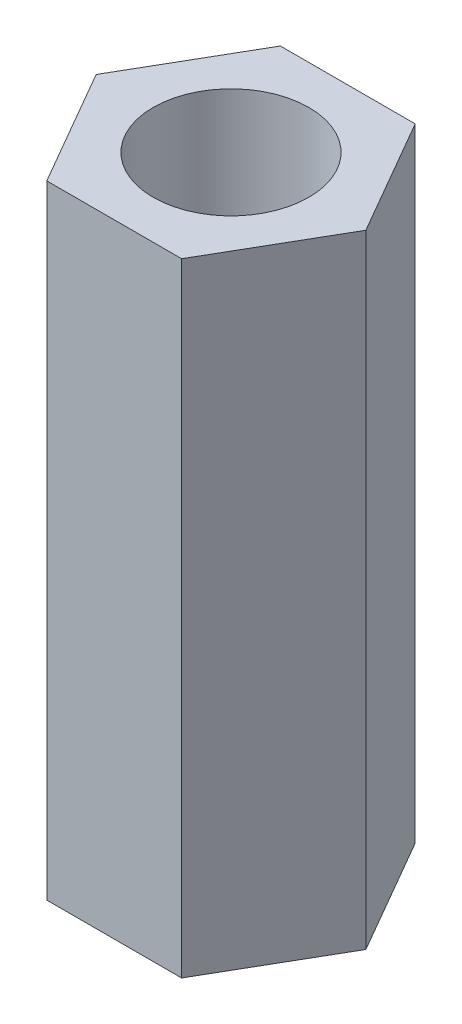
ISO-10303-21;
HEADER;
FILE_DESCRIPTION(('STEP AP214'),'2;1');
FILE_NAME('part.step','',(''),(''),'','','');
FILE_SCHEMA(('AUTOMOTIVE_DESIGN { 1 0 10303 214 1 1 1 1 }'));
ENDSEC;
DATA;
#1=APPLICATION_CONTEXT('core data for automotive mechanical design processes');
#2=APPLICATION_PROTOCOL_DEFINITION('international standard','automotive_design',2000,#1);
#3=PRODUCT_CONTEXT('',#1,'mechanical');
#4=PRODUCT('Part','Part','',(#3));
#5=PRODUCT_RELATED_PRODUCT_CATEGORY('part','',(#4));
#6=PRODUCT_DEFINITION_FORMATION('','',#4);
#7=PRODUCT_DEFINITION_CONTEXT('part definition',#1,'design');
#8=PRODUCT_DEFINITION('design','',#6,#7);
#9=PRODUCT_DEFINITION_SHAPE('','',#8);
#10=(LENGTH_UNIT() NAMED_UNIT(*) SI_UNIT(.MILLI.,.METRE.));
#11=(NAMED_UNIT(*) PLANE_ANGLE_UNIT() SI_UNIT($,.RADIAN.));
#12=(NAMED_UNIT(*) SI_UNIT($,.STERADIAN.) SOLID_ANGLE_UNIT());
#13=UNCERTAINTY_MEASURE_WITH_UNIT(LENGTH_MEASURE(1.E-05),#10,'distance_accuracy_value','');
#14=(GEOMETRIC_REPRESENTATION_CONTEXT(3) GLOBAL_UNCERTAINTY_ASSIGNED_CONTEXT((#13)) GLOBAL_UNIT_ASSIGNED_CONTEXT((#10,
#11,#12)) REPRESENTATION_CONTEXT('',''));
#15=CARTESIAN_POINT('',(0.,0.,0.));
#16=DIRECTION('',(0.,0.,1.));
#17=DIRECTION('',(1.,0.,0.));
#18=AXIS2_PLACEMENT_3D('',#15,#16,#17);
#19=CARTESIAN_POINT('',(1.29903810567666,12.,-2.25));
#20=DIRECTION('',(0.,0.,1.));
#21=DIRECTION('',(1.,0.,0.));
#22=AXIS2_PLACEMENT_3D('',#19,#20,#21);
#23=PLANE('',#22);
#24=DIRECTION('',(-1.,0.,0.));
#25=VECTOR('',#24,1.);
#26=CARTESIAN_POINT('',(1.29903810567666,0.,-2.25));
#27=LINE('',#26,#25);
#28=CARTESIAN_POINT('',(1.29903810567666,0.,-2.25));
#29=VERTEX_POINT('',#28);
#30=CARTESIAN_POINT('',(-1.29903810567666,0.,-2.25));
#31=VERTEX_POINT('',#30);
#32=EDGE_CURVE('E117',#29,#31,#27,.T.);
#33=ORIENTED_EDGE('',*,*,#32,.T.);
#34=DIRECTION('',(0.,-1.,0.));
#35=VECTOR('',#34,1.);
#36=CARTESIAN_POINT('',(-1.29903810567666,12.,-2.25));
#37=LINE('',#36,#35);
#38=CARTESIAN_POINT('',(-1.29903810567666,12.,-2.25));
#39=VERTEX_POINT('',#38);
#40=EDGE_CURVE('E11',#39,#31,#37,.T.);
#41=ORIENTED_EDGE('',*,*,#40,.F.);
#42=DIRECTION('',(-1.,0.,0.));
#43=VECTOR('',#42,1.);
#44=CARTESIAN_POINT('',(1.29903810567666,12.,-2.25));
#45=LINE('',#44,#43);
#46=CARTESIAN_POINT('',(1.29903810567666,12.,-2.25));
#47=VERTEX_POINT('',#46);
#48=EDGE_CURVE('E128',#47,#39,#45,.T.);
#49=ORIENTED_EDGE('',*,*,#48,.F.);
#50=DIRECTION('',(0.,-1.,0.));
#51=VECTOR('',#50,1.);
#52=CARTESIAN_POINT('',(1.29903810567666,12.,-2.25));
#53=LINE('',#52,#51);
#54=EDGE_CURVE('E113',#47,#29,#53,.T.);
#55=ORIENTED_EDGE('',*,*,#54,.T.);
#56=EDGE_LOOP('',(#33,#41,#49,#55));
#57=FACE_BOUND('',#56,.T.);
#58=ADVANCED_FACE('F33',(#57),#23,.F.);
#59=CARTESIAN_POINT('',(-1.29903810567666,12.,-2.25));
#60=DIRECTION('',(0.866025403784439,0.,0.5));
#61=DIRECTION('',(0.5,0.,-0.866025403784439));
#62=AXIS2_PLACEMENT_3D('',#59,#60,#61);
#63=PLANE('',#62);
#64=DIRECTION('',(-0.5,0.,0.866025403784439));
#65=VECTOR('',#64,1.);
#66=CARTESIAN_POINT('',(-1.29903810567666,0.,-2.25));
#67=LINE('',#66,#65);
#68=CARTESIAN_POINT('',(-2.59807621135332,0.,0.));
#69=VERTEX_POINT('',#68);
#70=EDGE_CURVE('E120',#31,#69,#67,.T.);
#71=ORIENTED_EDGE('',*,*,#70,.T.);
#72=DIRECTION('',(0.,-1.,0.));
#73=VECTOR('',#72,1.);
#74=CARTESIAN_POINT('',(-2.59807621135332,12.,0.));
#75=LINE('',#74,#73);
#76=CARTESIAN_POINT('',(-2.59807621135332,12.,0.));
#77=VERTEX_POINT('',#76);
#78=EDGE_CURVE('E41',#77,#69,#75,.T.);
#79=ORIENTED_EDGE('',*,*,#78,.F.);
#80=DIRECTION('',(-0.5,0.,0.866025403784439));
#81=VECTOR('',#80,1.);
#82=CARTESIAN_POINT('',(-1.29903810567666,12.,-2.25));
#83=LINE('',#82,#81);
#84=EDGE_CURVE('E86',#39,#77,#83,.T.);
#85=ORIENTED_EDGE('',*,*,#84,.F.);
#86=ORIENTED_EDGE('',*,*,#40,.T.);
#87=EDGE_LOOP('',(#71,#79,#85,#86));
#88=FACE_BOUND('',#87,.T.);
#89=ADVANCED_FACE('F153',(#88),#63,.F.);
#90=CARTESIAN_POINT('',(-2.59807621135332,12.,0.));
#91=DIRECTION('',(0.866025403784438,0.,-0.5));
#92=DIRECTION('',(-0.5,0.,-0.866025403784439));
#93=AXIS2_PLACEMENT_3D('',#90,#91,#92);
#94=PLANE('',#93);
#95=DIRECTION('',(0.5,0.,0.866025403784438));
#96=VECTOR('',#95,1.);
#97=CARTESIAN_POINT('',(-2.59807621135332,0.,0.));
#98=LINE('',#97,#96);
#99=CARTESIAN_POINT('',(-1.29903810567666,0.,2.25));
#100=VERTEX_POINT('',#99);
#101=EDGE_CURVE('E123',#69,#100,#98,.T.);
#102=ORIENTED_EDGE('',*,*,#101,.T.);
#103=DIRECTION('',(0.,-1.,0.));
#104=VECTOR('',#103,1.);
#105=CARTESIAN_POINT('',(-1.29903810567666,12.,2.25));
#106=LINE('',#105,#104);
#107=CARTESIAN_POINT('',(-1.29903810567666,12.,2.25));
#108=VERTEX_POINT('',#107);
#109=EDGE_CURVE('E108',#108,#100,#106,.T.);
#110=ORIENTED_EDGE('',*,*,#109,.F.);
#111=DIRECTION('',(0.5,0.,0.866025403784438));
#112=VECTOR('',#111,1.);
#113=CARTESIAN_POINT('',(-2.59807621135332,12.,0.));
#114=LINE('',#113,#112);
#115=EDGE_CURVE('E99',#77,#108,#114,.T.);
#116=ORIENTED_EDGE('',*,*,#115,.F.);
#117=ORIENTED_EDGE('',*,*,#78,.T.);
#118=EDGE_LOOP('',(#102,#110,#116,#117));
#119=FACE_BOUND('',#118,.T.);
#120=ADVANCED_FACE('F134',(#119),#94,.F.);
#121=CARTESIAN_POINT('',(-1.29903810567666,12.,2.25));
#122=DIRECTION('',(0.,0.,-1.));
#123=DIRECTION('',(-1.,0.,0.));
#124=AXIS2_PLACEMENT_3D('',#121,#122,#123);
#125=PLANE('',#124);
#126=DIRECTION('',(1.,0.,0.));
#127=VECTOR('',#126,1.);
#128=CARTESIAN_POINT('',(-1.29903810567666,0.,2.25));
#129=LINE('',#128,#127);
#130=CARTESIAN_POINT('',(1.29903810567666,0.,2.25));
#131=VERTEX_POINT('',#130);
#132=EDGE_CURVE('E107',#100,#131,#129,.T.);
#133=ORIENTED_EDGE('',*,*,#132,.T.);
#134=DIRECTION('',(0.,-1.,0.));
#135=VECTOR('',#134,1.);
#136=CARTESIAN_POINT('',(1.29903810567666,12.,2.25));
#137=LINE('',#136,#135);
#138=CARTESIAN_POINT('',(1.29903810567666,12.,2.25));
#139=VERTEX_POINT('',#138);
#140=EDGE_CURVE('E104',#139,#131,#137,.T.);
#141=ORIENTED_EDGE('',*,*,#140,.F.);
#142=DIRECTION('',(1.,0.,0.));
#143=VECTOR('',#142,1.);
#144=CARTESIAN_POINT('',(-1.29903810567666,12.,2.25));
#145=LINE('',#144,#143);
#146=EDGE_CURVE('E93',#108,#139,#145,.T.);
#147=ORIENTED_EDGE('',*,*,#146,.F.);
#148=ORIENTED_EDGE('',*,*,#109,.T.);
#149=EDGE_LOOP('',(#133,#141,#147,#148));
#150=FACE_BOUND('',#149,.T.);
#151=ADVANCED_FACE('F105',(#150),#125,.F.);
#152=CARTESIAN_POINT('',(1.29903810567666,12.,2.25));
#153=DIRECTION('',(-0.866025403784439,0.,-0.5));
#154=DIRECTION('',(-0.5,0.,0.866025403784439));
#155=AXIS2_PLACEMENT_3D('',#152,#153,#154);
#156=PLANE('',#155);
#157=DIRECTION('',(0.5,0.,-0.866025403784439));
#158=VECTOR('',#157,1.);
#159=CARTESIAN_POINT('',(1.29903810567666,0.,2.25));
#160=LINE('',#159,#158);
#161=CARTESIAN_POINT('',(2.59807621135332,0.,0.));
#162=VERTEX_POINT('',#161);
#163=EDGE_CURVE('E72',#131,#162,#160,.T.);
#164=ORIENTED_EDGE('',*,*,#163,.T.);
#165=DIRECTION('',(0.,-1.,0.));
#166=VECTOR('',#165,1.);
#167=CARTESIAN_POINT('',(2.59807621135332,12.,0.));
#168=LINE('',#167,#166);
#169=CARTESIAN_POINT('',(2.59807621135332,12.,0.));
#170=VERTEX_POINT('',#169);
#171=EDGE_CURVE('E109',#170,#162,#168,.T.);
#172=ORIENTED_EDGE('',*,*,#171,.F.);
#173=DIRECTION('',(0.5,0.,-0.866025403784439));
#174=VECTOR('',#173,1.);
#175=CARTESIAN_POINT('',(1.29903810567666,12.,2.25));
#176=LINE('',#175,#174);
#177=EDGE_CURVE('E97',#139,#170,#176,.T.);
#178=ORIENTED_EDGE('',*,*,#177,.F.);
#179=ORIENTED_EDGE('',*,*,#140,.T.);
#180=EDGE_LOOP('',(#164,#172,#178,#179));
#181=FACE_BOUND('',#180,.T.);
#182=ADVANCED_FACE('F111',(#181),#156,.F.);
#183=CARTESIAN_POINT('',(2.59807621135332,12.,0.));
#184=DIRECTION('',(-0.866025403784439,0.,0.5));
#185=DIRECTION('',(0.5,0.,0.866025403784439));
#186=AXIS2_PLACEMENT_3D('',#183,#184,#185);
#187=PLANE('',#186);
#188=DIRECTION('',(-0.5,0.,-0.866025403784438));
#189=VECTOR('',#188,1.);
#190=CARTESIAN_POINT('',(2.59807621135332,0.,0.));
#191=LINE('',#190,#189);
#192=EDGE_CURVE('E78',#162,#29,#191,.T.);
#193=ORIENTED_EDGE('',*,*,#192,.T.);
#194=ORIENTED_EDGE('',*,*,#54,.F.);
#195=DIRECTION('',(-0.5,0.,-0.866025403784438));
#196=VECTOR('',#195,1.);
#197=CARTESIAN_POINT('',(2.59807621135332,12.,0.));
#198=LINE('',#197,#196);
#199=EDGE_CURVE('E49',#170,#47,#198,.T.);
#200=ORIENTED_EDGE('',*,*,#199,.F.);
#201=ORIENTED_EDGE('',*,*,#171,.T.);
#202=EDGE_LOOP('',(#193,#194,#200,#201));
#203=FACE_BOUND('',#202,.T.);
#204=ADVANCED_FACE('F141',(#203),#187,.F.);
#205=CARTESIAN_POINT('',(0.,12.,0.));
#206=DIRECTION('',(0.,1.,0.));
#207=DIRECTION('',(0.,0.,1.));
#208=AXIS2_PLACEMENT_3D('',#205,#206,#207);
#209=PLANE('',#208);
#210=CARTESIAN_POINT('',(0.,12.,0.));
#211=DIRECTION('',(0.,1.,0.));
#212=DIRECTION('',(0.,0.,1.));
#213=AXIS2_PLACEMENT_3D('',#210,#211,#212);
#214=CIRCLE('',#213,1.5);
#215=CARTESIAN_POINT('',(0.,12.,1.5));
#216=VERTEX_POINT('',#215);
#217=EDGE_CURVE('E208',#216,#216,#214,.T.);
#218=ORIENTED_EDGE('',*,*,#217,.F.);
#219=EDGE_LOOP('',(#218));
#220=FACE_BOUND('',#219,.T.);
#221=ORIENTED_EDGE('',*,*,#48,.T.);
#222=ORIENTED_EDGE('',*,*,#84,.T.);
#223=ORIENTED_EDGE('',*,*,#115,.T.);
#224=ORIENTED_EDGE('',*,*,#146,.T.);
#225=ORIENTED_EDGE('',*,*,#177,.T.);
#226=ORIENTED_EDGE('',*,*,#199,.T.);
#227=EDGE_LOOP('',(#221,#222,#223,#224,#225,#226));
#228=FACE_BOUND('',#227,.T.);
#229=ADVANCED_FACE('F95',(#220,#228),#209,.T.);
#230=CARTESIAN_POINT('',(0.,0.,0.));
#231=DIRECTION('',(0.,1.,0.));
#232=DIRECTION('',(0.,0.,1.));
#233=AXIS2_PLACEMENT_3D('',#230,#231,#232);
#234=PLANE('',#233);
#235=CARTESIAN_POINT('',(0.,0.,0.));
#236=DIRECTION('',(0.,1.,0.));
#237=DIRECTION('',(0.,0.,1.));
#238=AXIS2_PLACEMENT_3D('',#235,#236,#237);
#239=CIRCLE('',#238,1.5);
#240=CARTESIAN_POINT('',(0.,0.,1.5));
#241=VERTEX_POINT('',#240);
#242=EDGE_CURVE('E121',#241,#241,#239,.T.);
#243=ORIENTED_EDGE('',*,*,#242,.T.);
#244=EDGE_LOOP('',(#243));
#245=FACE_BOUND('',#244,.T.);
#246=ORIENTED_EDGE('',*,*,#32,.F.);
#247=ORIENTED_EDGE('',*,*,#192,.F.);
#248=ORIENTED_EDGE('',*,*,#163,.F.);
#249=ORIENTED_EDGE('',*,*,#132,.F.);
#250=ORIENTED_EDGE('',*,*,#101,.F.);
#251=ORIENTED_EDGE('',*,*,#70,.F.);
#252=EDGE_LOOP('',(#246,#247,#248,#249,#250,#251));
#253=FACE_BOUND('',#252,.T.);
#254=ADVANCED_FACE('F137',(#245,#253),#234,.F.);
#255=CARTESIAN_POINT('',(0.,0.,0.));
#256=DIRECTION('',(0.,1.,0.));
#257=DIRECTION('',(0.,0.,1.));
#258=AXIS2_PLACEMENT_3D('',#255,#256,#257);
#259=CYLINDRICAL_SURFACE('',#258,1.5);
#260=ORIENTED_EDGE('',*,*,#242,.F.);
#261=EDGE_LOOP('',(#260));
#262=FACE_BOUND('',#261,.T.);
#263=ORIENTED_EDGE('',*,*,#217,.T.);
#264=EDGE_LOOP('',(#263));
#265=FACE_BOUND('',#264,.T.);
#266=ADVANCED_FACE('F190',(#262,#265),#259,.F.);
#267=CLOSED_SHELL('',(#58,#89,#120,#151,#182,#204,#229,#254,#266));
#268=MANIFOLD_SOLID_BREP('B2',#267);
#269=ADVANCED_BREP_SHAPE_REPRESENTATION('',(#18,#268),#14);
#270=SHAPE_DEFINITION_REPRESENTATION(#9,#269);
ENDSEC;
END-ISO-10303-21;
